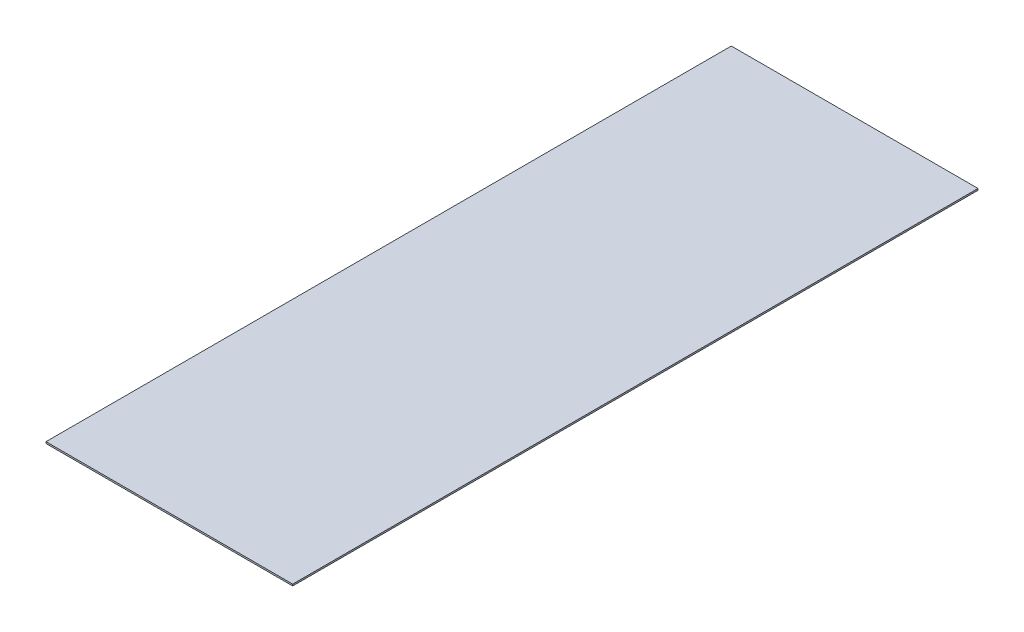
ISO-10303-21;
HEADER;
FILE_DESCRIPTION(('STEP AP214'),'2;1');
FILE_NAME('part.step','',(''),(''),'','','');
FILE_SCHEMA(('AUTOMOTIVE_DESIGN { 1 0 10303 214 1 1 1 1 }'));
ENDSEC;
DATA;
#1=APPLICATION_CONTEXT('core data for automotive mechanical design processes');
#2=APPLICATION_PROTOCOL_DEFINITION('international standard','automotive_design',2000,#1);
#3=PRODUCT_CONTEXT('',#1,'mechanical');
#4=PRODUCT('Part','Part','',(#3));
#5=PRODUCT_RELATED_PRODUCT_CATEGORY('part','',(#4));
#6=PRODUCT_DEFINITION_FORMATION('','',#4);
#7=PRODUCT_DEFINITION_CONTEXT('part definition',#1,'design');
#8=PRODUCT_DEFINITION('design','',#6,#7);
#9=PRODUCT_DEFINITION_SHAPE('','',#8);
#10=(LENGTH_UNIT() NAMED_UNIT(*) SI_UNIT(.MILLI.,.METRE.));
#11=(NAMED_UNIT(*) PLANE_ANGLE_UNIT() SI_UNIT($,.RADIAN.));
#12=(NAMED_UNIT(*) SI_UNIT($,.STERADIAN.) SOLID_ANGLE_UNIT());
#13=UNCERTAINTY_MEASURE_WITH_UNIT(LENGTH_MEASURE(1.E-05),#10,'distance_accuracy_value','');
#14=(GEOMETRIC_REPRESENTATION_CONTEXT(3) GLOBAL_UNCERTAINTY_ASSIGNED_CONTEXT((#13)) GLOBAL_UNIT_ASSIGNED_CONTEXT((#10,
#11,#12)) REPRESENTATION_CONTEXT('',''));
#15=CARTESIAN_POINT('',(0.,0.,0.));
#16=DIRECTION('',(0.,0.,1.));
#17=DIRECTION('',(1.,0.,0.));
#18=AXIS2_PLACEMENT_3D('',#15,#16,#17);
#19=CARTESIAN_POINT('',(0.,-0.762,0.));
#20=DIRECTION('',(-1.,0.,0.));
#21=DIRECTION('',(0.,0.,1.));
#22=AXIS2_PLACEMENT_3D('',#19,#20,#21);
#23=PLANE('',#22);
#24=DIRECTION('',(0.,0.,1.));
#25=VECTOR('',#24,1.);
#26=CARTESIAN_POINT('',(0.,0.,0.));
#27=LINE('',#26,#25);
#28=CARTESIAN_POINT('',(0.,0.,-317.5));
#29=VERTEX_POINT('',#28);
#30=CARTESIAN_POINT('',(0.,0.,0.));
#31=VERTEX_POINT('',#30);
#32=EDGE_CURVE('E98',#29,#31,#27,.T.);
#33=ORIENTED_EDGE('',*,*,#32,.F.);
#34=DIRECTION('',(0.,1.,0.));
#35=VECTOR('',#34,1.);
#36=CARTESIAN_POINT('',(0.,-0.762,-317.5));
#37=LINE('',#36,#35);
#38=CARTESIAN_POINT('',(0.,-0.762,-317.5));
#39=VERTEX_POINT('',#38);
#40=EDGE_CURVE('E11',#39,#29,#37,.T.);
#41=ORIENTED_EDGE('',*,*,#40,.F.);
#42=DIRECTION('',(0.,0.,1.));
#43=VECTOR('',#42,1.);
#44=CARTESIAN_POINT('',(0.,-0.762,0.));
#45=LINE('',#44,#43);
#46=CARTESIAN_POINT('',(0.,-0.762,0.));
#47=VERTEX_POINT('',#46);
#48=EDGE_CURVE('E92',#39,#47,#45,.T.);
#49=ORIENTED_EDGE('',*,*,#48,.T.);
#50=DIRECTION('',(0.,1.,0.));
#51=VECTOR('',#50,1.);
#52=CARTESIAN_POINT('',(0.,-0.762,0.));
#53=LINE('',#52,#51);
#54=EDGE_CURVE('E37',#47,#31,#53,.T.);
#55=ORIENTED_EDGE('',*,*,#54,.T.);
#56=EDGE_LOOP('',(#33,#41,#49,#55));
#57=FACE_BOUND('',#56,.T.);
#58=ADVANCED_FACE('F34',(#57),#23,.T.);
#59=CARTESIAN_POINT('',(0.,-0.762,-317.5));
#60=DIRECTION('',(0.,0.,-1.));
#61=DIRECTION('',(-1.,0.,0.));
#62=AXIS2_PLACEMENT_3D('',#59,#60,#61);
#63=PLANE('',#62);
#64=DIRECTION('',(-1.,0.,0.));
#65=VECTOR('',#64,1.);
#66=CARTESIAN_POINT('',(0.,0.,-317.5));
#67=LINE('',#66,#65);
#68=CARTESIAN_POINT('',(114.3,0.,-317.5));
#69=VERTEX_POINT('',#68);
#70=EDGE_CURVE('E94',#69,#29,#67,.T.);
#71=ORIENTED_EDGE('',*,*,#70,.F.);
#72=DIRECTION('',(0.,1.,0.));
#73=VECTOR('',#72,1.);
#74=CARTESIAN_POINT('',(114.3,-0.762,-317.5));
#75=LINE('',#74,#73);
#76=CARTESIAN_POINT('',(114.3,-0.762,-317.5));
#77=VERTEX_POINT('',#76);
#78=EDGE_CURVE('E43',#77,#69,#75,.T.);
#79=ORIENTED_EDGE('',*,*,#78,.F.);
#80=DIRECTION('',(-1.,0.,0.));
#81=VECTOR('',#80,1.);
#82=CARTESIAN_POINT('',(0.,-0.762,-317.5));
#83=LINE('',#82,#81);
#84=EDGE_CURVE('E89',#77,#39,#83,.T.);
#85=ORIENTED_EDGE('',*,*,#84,.T.);
#86=ORIENTED_EDGE('',*,*,#40,.T.);
#87=EDGE_LOOP('',(#71,#79,#85,#86));
#88=FACE_BOUND('',#87,.T.);
#89=ADVANCED_FACE('F108',(#88),#63,.T.);
#90=CARTESIAN_POINT('',(114.3,-0.762,0.));
#91=DIRECTION('',(1.,0.,0.));
#92=DIRECTION('',(0.,0.,-1.));
#93=AXIS2_PLACEMENT_3D('',#90,#91,#92);
#94=PLANE('',#93);
#95=DIRECTION('',(0.,0.,-1.));
#96=VECTOR('',#95,1.);
#97=CARTESIAN_POINT('',(114.3,0.,0.));
#98=LINE('',#97,#96);
#99=CARTESIAN_POINT('',(114.3,0.,0.));
#100=VERTEX_POINT('',#99);
#101=EDGE_CURVE('E84',#100,#69,#98,.T.);
#102=ORIENTED_EDGE('',*,*,#101,.F.);
#103=DIRECTION('',(0.,1.,0.));
#104=VECTOR('',#103,1.);
#105=CARTESIAN_POINT('',(114.3,-0.762,0.));
#106=LINE('',#105,#104);
#107=CARTESIAN_POINT('',(114.3,-0.762,0.));
#108=VERTEX_POINT('',#107);
#109=EDGE_CURVE('E79',#108,#100,#106,.T.);
#110=ORIENTED_EDGE('',*,*,#109,.F.);
#111=DIRECTION('',(0.,0.,-1.));
#112=VECTOR('',#111,1.);
#113=CARTESIAN_POINT('',(114.3,-0.762,0.));
#114=LINE('',#113,#112);
#115=EDGE_CURVE('E82',#108,#77,#114,.T.);
#116=ORIENTED_EDGE('',*,*,#115,.T.);
#117=ORIENTED_EDGE('',*,*,#78,.T.);
#118=EDGE_LOOP('',(#102,#110,#116,#117));
#119=FACE_BOUND('',#118,.T.);
#120=ADVANCED_FACE('F81',(#119),#94,.T.);
#121=CARTESIAN_POINT('',(0.,-0.762,0.));
#122=DIRECTION('',(0.,0.,1.));
#123=DIRECTION('',(1.,0.,0.));
#124=AXIS2_PLACEMENT_3D('',#121,#122,#123);
#125=PLANE('',#124);
#126=DIRECTION('',(1.,0.,0.));
#127=VECTOR('',#126,1.);
#128=CARTESIAN_POINT('',(0.,0.,0.));
#129=LINE('',#128,#127);
#130=EDGE_CURVE('E101',#31,#100,#129,.T.);
#131=ORIENTED_EDGE('',*,*,#130,.F.);
#132=ORIENTED_EDGE('',*,*,#54,.F.);
#133=DIRECTION('',(1.,0.,0.));
#134=VECTOR('',#133,1.);
#135=CARTESIAN_POINT('',(0.,-0.762,0.));
#136=LINE('',#135,#134);
#137=EDGE_CURVE('E88',#47,#108,#136,.T.);
#138=ORIENTED_EDGE('',*,*,#137,.T.);
#139=ORIENTED_EDGE('',*,*,#109,.T.);
#140=EDGE_LOOP('',(#131,#132,#138,#139));
#141=FACE_BOUND('',#140,.T.);
#142=ADVANCED_FACE('F91',(#141),#125,.T.);
#143=CARTESIAN_POINT('',(0.,-0.762,-317.5));
#144=DIRECTION('',(0.,-1.,0.));
#145=DIRECTION('',(0.,0.,-1.));
#146=AXIS2_PLACEMENT_3D('',#143,#144,#145);
#147=PLANE('',#146);
#148=ORIENTED_EDGE('',*,*,#48,.F.);
#149=ORIENTED_EDGE('',*,*,#84,.F.);
#150=ORIENTED_EDGE('',*,*,#115,.F.);
#151=ORIENTED_EDGE('',*,*,#137,.F.);
#152=EDGE_LOOP('',(#148,#149,#150,#151));
#153=FACE_BOUND('',#152,.T.);
#154=ADVANCED_FACE('F87',(#153),#147,.T.);
#155=CARTESIAN_POINT('',(0.,0.,-317.5));
#156=DIRECTION('',(0.,-1.,0.));
#157=DIRECTION('',(0.,0.,-1.));
#158=AXIS2_PLACEMENT_3D('',#155,#156,#157);
#159=PLANE('',#158);
#160=ORIENTED_EDGE('',*,*,#32,.T.);
#161=ORIENTED_EDGE('',*,*,#130,.T.);
#162=ORIENTED_EDGE('',*,*,#101,.T.);
#163=ORIENTED_EDGE('',*,*,#70,.T.);
#164=EDGE_LOOP('',(#160,#161,#162,#163));
#165=FACE_BOUND('',#164,.T.);
#166=ADVANCED_FACE('F107',(#165),#159,.F.);
#167=CLOSED_SHELL('',(#58,#89,#120,#142,#154,#166));
#168=MANIFOLD_SOLID_BREP('B2',#167);
#169=ADVANCED_BREP_SHAPE_REPRESENTATION('',(#18,#168),#14);
#170=SHAPE_DEFINITION_REPRESENTATION(#9,#169);
ENDSEC;
END-ISO-10303-21;
